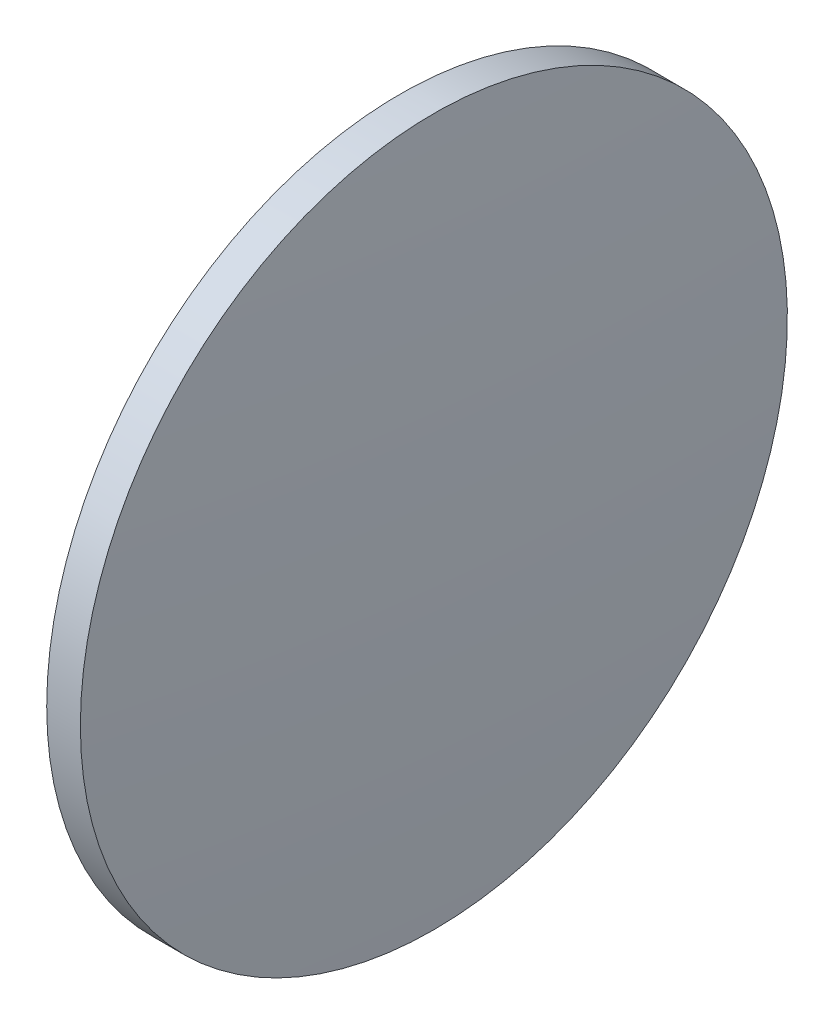
ISO-10303-21;
HEADER;
FILE_DESCRIPTION(('STEP AP214'),'2;1');
FILE_NAME('part.step','',(''),(''),'','','');
FILE_SCHEMA(('AUTOMOTIVE_DESIGN { 1 0 10303 214 1 1 1 1 }'));
ENDSEC;
DATA;
#1=APPLICATION_CONTEXT('core data for automotive mechanical design processes');
#2=APPLICATION_PROTOCOL_DEFINITION('international standard','automotive_design',2000,#1);
#3=PRODUCT_CONTEXT('',#1,'mechanical');
#4=PRODUCT('Part','Part','',(#3));
#5=PRODUCT_RELATED_PRODUCT_CATEGORY('part','',(#4));
#6=PRODUCT_DEFINITION_FORMATION('','',#4);
#7=PRODUCT_DEFINITION_CONTEXT('part definition',#1,'design');
#8=PRODUCT_DEFINITION('design','',#6,#7);
#9=PRODUCT_DEFINITION_SHAPE('','',#8);
#10=(LENGTH_UNIT() NAMED_UNIT(*) SI_UNIT(.MILLI.,.METRE.));
#11=(NAMED_UNIT(*) PLANE_ANGLE_UNIT() SI_UNIT($,.RADIAN.));
#12=(NAMED_UNIT(*) SI_UNIT($,.STERADIAN.) SOLID_ANGLE_UNIT());
#13=UNCERTAINTY_MEASURE_WITH_UNIT(LENGTH_MEASURE(1.E-05),#10,'distance_accuracy_value','');
#14=(GEOMETRIC_REPRESENTATION_CONTEXT(3) GLOBAL_UNCERTAINTY_ASSIGNED_CONTEXT((#13)) GLOBAL_UNIT_ASSIGNED_CONTEXT((#10,
#11,#12)) REPRESENTATION_CONTEXT('',''));
#15=CARTESIAN_POINT('',(0.,0.,0.));
#16=DIRECTION('',(0.,0.,1.));
#17=DIRECTION('',(1.,0.,0.));
#18=AXIS2_PLACEMENT_3D('',#15,#16,#17);
#19=CARTESIAN_POINT('',(-286.423573998609,130.518581456957,0.));
#20=DIRECTION('',(-1.,0.,0.));
#21=DIRECTION('',(0.,-1.,0.));
#22=AXIS2_PLACEMENT_3D('',#19,#20,#21);
#23=SPHERICAL_SURFACE('',#22,517.276874999996);
#24=CARTESIAN_POINT('',(229.893301001387,130.518581456956,0.));
#25=DIRECTION('',(-1.,0.,0.));
#26=DIRECTION('',(0.,0.,1.));
#27=AXIS2_PLACEMENT_3D('',#24,#25,#26);
#28=CIRCLE('',#27,31.5);
#29=CARTESIAN_POINT('',(229.893301001387,130.518581456956,31.5));
#30=VERTEX_POINT('',#29);
#31=EDGE_CURVE('E10',#30,#30,#28,.T.);
#32=ORIENTED_EDGE('',*,*,#31,.F.);
#33=EDGE_LOOP('',(#32));
#34=FACE_BOUND('',#33,.T.);
#35=ADVANCED_FACE('F35',(#34),#23,.T.);
#36=CARTESIAN_POINT('',(218.123666737155,130.518581456956,0.));
#37=DIRECTION('',(-1.,0.,0.));
#38=DIRECTION('',(0.,0.,1.));
#39=AXIS2_PLACEMENT_3D('',#36,#37,#38);
#40=CYLINDRICAL_SURFACE('',#39,31.5);
#41=CARTESIAN_POINT('',(226.893301001387,130.518581456956,0.));
#42=DIRECTION('',(-1.,0.,0.));
#43=DIRECTION('',(0.,0.,1.));
#44=AXIS2_PLACEMENT_3D('',#41,#42,#43);
#45=CIRCLE('',#44,31.5);
#46=CARTESIAN_POINT('',(226.893301001387,130.518581456956,31.5));
#47=VERTEX_POINT('',#46);
#48=EDGE_CURVE('E41',#47,#47,#45,.T.);
#49=ORIENTED_EDGE('',*,*,#48,.F.);
#50=EDGE_LOOP('',(#49));
#51=FACE_BOUND('',#50,.T.);
#52=ORIENTED_EDGE('',*,*,#31,.T.);
#53=EDGE_LOOP('',(#52));
#54=FACE_BOUND('',#53,.T.);
#55=ADVANCED_FACE('F49',(#51,#54),#40,.T.);
#56=CARTESIAN_POINT('',(226.893301001387,130.518581456956,0.));
#57=DIRECTION('',(1.,0.,0.));
#58=DIRECTION('',(0.,0.,-1.));
#59=AXIS2_PLACEMENT_3D('',#56,#57,#58);
#60=PLANE('',#59);
#61=ORIENTED_EDGE('',*,*,#48,.T.);
#62=EDGE_LOOP('',(#61));
#63=FACE_BOUND('',#62,.T.);
#64=ADVANCED_FACE('F47',(#63),#60,.F.);
#65=CLOSED_SHELL('',(#35,#55,#64));
#66=MANIFOLD_SOLID_BREP('B2',#65);
#67=ADVANCED_BREP_SHAPE_REPRESENTATION('',(#18,#66),#14);
#68=SHAPE_DEFINITION_REPRESENTATION(#9,#67);
ENDSEC;
END-ISO-10303-21;
